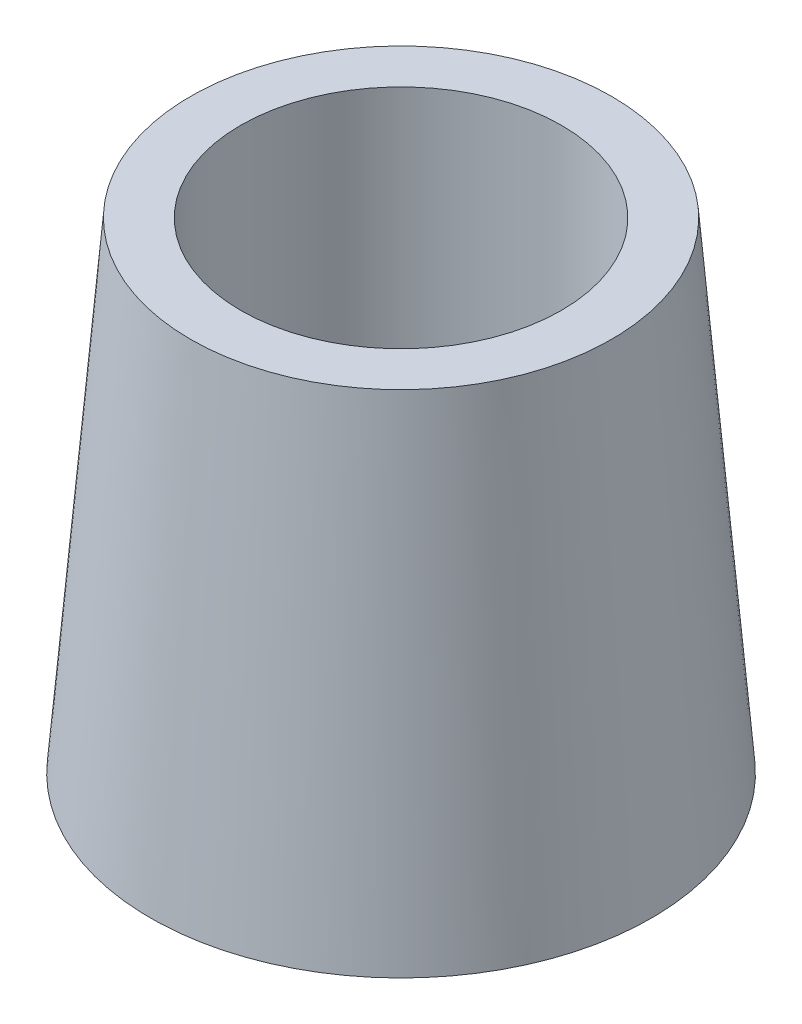
ISO-10303-21;
HEADER;
FILE_DESCRIPTION(('STEP AP214'),'2;1');
FILE_NAME('part.step','',(''),(''),'','','');
FILE_SCHEMA(('AUTOMOTIVE_DESIGN { 1 0 10303 214 1 1 1 1 }'));
ENDSEC;
DATA;
#1=APPLICATION_CONTEXT('core data for automotive mechanical design processes');
#2=APPLICATION_PROTOCOL_DEFINITION('international standard','automotive_design',2000,#1);
#3=PRODUCT_CONTEXT('',#1,'mechanical');
#4=PRODUCT('Part','Part','',(#3));
#5=PRODUCT_RELATED_PRODUCT_CATEGORY('part','',(#4));
#6=PRODUCT_DEFINITION_FORMATION('','',#4);
#7=PRODUCT_DEFINITION_CONTEXT('part definition',#1,'design');
#8=PRODUCT_DEFINITION('design','',#6,#7);
#9=PRODUCT_DEFINITION_SHAPE('','',#8);
#10=(LENGTH_UNIT() NAMED_UNIT(*) SI_UNIT(.MILLI.,.METRE.));
#11=(NAMED_UNIT(*) PLANE_ANGLE_UNIT() SI_UNIT($,.RADIAN.));
#12=(NAMED_UNIT(*) SI_UNIT($,.STERADIAN.) SOLID_ANGLE_UNIT());
#13=UNCERTAINTY_MEASURE_WITH_UNIT(LENGTH_MEASURE(1.E-05),#10,'distance_accuracy_value','');
#14=(GEOMETRIC_REPRESENTATION_CONTEXT(3) GLOBAL_UNCERTAINTY_ASSIGNED_CONTEXT((#13)) GLOBAL_UNIT_ASSIGNED_CONTEXT((#10,
#11,#12)) REPRESENTATION_CONTEXT('',''));
#15=CARTESIAN_POINT('',(0.,0.,0.));
#16=DIRECTION('',(0.,0.,1.));
#17=DIRECTION('',(1.,0.,0.));
#18=AXIS2_PLACEMENT_3D('',#15,#16,#17);
#19=CARTESIAN_POINT('',(0.,0.,0.));
#20=DIRECTION('',(0.,-1.,0.));
#21=DIRECTION('',(0.,0.,-1.));
#22=AXIS2_PLACEMENT_3D('',#19,#20,#21);
#23=CONICAL_SURFACE('',#22,12.5,0.0831412318884412);
#24=CARTESIAN_POINT('',(0.,24.,0.));
#25=DIRECTION('',(0.,-1.,0.));
#26=DIRECTION('',(0.,0.,-1.));
#27=AXIS2_PLACEMENT_3D('',#24,#25,#26);
#28=CIRCLE('',#27,10.5);
#29=CARTESIAN_POINT('',(0.,24.,-10.5));
#30=VERTEX_POINT('',#29);
#31=EDGE_CURVE('E10',#30,#30,#28,.T.);
#32=ORIENTED_EDGE('',*,*,#31,.T.);
#33=EDGE_LOOP('',(#32));
#34=FACE_BOUND('',#33,.T.);
#35=CARTESIAN_POINT('',(0.,0.,0.));
#36=DIRECTION('',(0.,-1.,0.));
#37=DIRECTION('',(0.,0.,-1.));
#38=AXIS2_PLACEMENT_3D('',#35,#36,#37);
#39=CIRCLE('',#38,12.5);
#40=CARTESIAN_POINT('',(0.,0.,-12.5));
#41=VERTEX_POINT('',#40);
#42=EDGE_CURVE('E49',#41,#41,#39,.T.);
#43=ORIENTED_EDGE('',*,*,#42,.F.);
#44=EDGE_LOOP('',(#43));
#45=FACE_BOUND('',#44,.T.);
#46=ADVANCED_FACE('F35',(#34,#45),#23,.T.);
#47=CARTESIAN_POINT('',(10.5,24.,0.));
#48=DIRECTION('',(0.,1.,0.));
#49=DIRECTION('',(0.,0.,1.));
#50=AXIS2_PLACEMENT_3D('',#47,#48,#49);
#51=PLANE('',#50);
#52=CARTESIAN_POINT('',(0.,24.,0.));
#53=DIRECTION('',(0.,-1.,0.));
#54=DIRECTION('',(0.,0.,-1.));
#55=AXIS2_PLACEMENT_3D('',#52,#53,#54);
#56=CIRCLE('',#55,8.);
#57=CARTESIAN_POINT('',(0.,24.,-8.));
#58=VERTEX_POINT('',#57);
#59=EDGE_CURVE('E41',#58,#58,#56,.T.);
#60=ORIENTED_EDGE('',*,*,#59,.T.);
#61=EDGE_LOOP('',(#60));
#62=FACE_BOUND('',#61,.T.);
#63=ORIENTED_EDGE('',*,*,#31,.F.);
#64=EDGE_LOOP('',(#63));
#65=FACE_BOUND('',#64,.T.);
#66=ADVANCED_FACE('F59',(#62,#65),#51,.T.);
#67=CARTESIAN_POINT('',(0.,0.,0.));
#68=DIRECTION('',(0.,-1.,0.));
#69=DIRECTION('',(0.,0.,-1.));
#70=AXIS2_PLACEMENT_3D('',#67,#68,#69);
#71=CYLINDRICAL_SURFACE('',#70,8.);
#72=CARTESIAN_POINT('',(0.,0.,0.));
#73=DIRECTION('',(0.,-1.,0.));
#74=DIRECTION('',(0.,0.,-1.));
#75=AXIS2_PLACEMENT_3D('',#72,#73,#74);
#76=CIRCLE('',#75,8.);
#77=CARTESIAN_POINT('',(0.,0.,-8.));
#78=VERTEX_POINT('',#77);
#79=EDGE_CURVE('E45',#78,#78,#76,.T.);
#80=ORIENTED_EDGE('',*,*,#79,.T.);
#81=EDGE_LOOP('',(#80));
#82=FACE_BOUND('',#81,.T.);
#83=ORIENTED_EDGE('',*,*,#59,.F.);
#84=EDGE_LOOP('',(#83));
#85=FACE_BOUND('',#84,.T.);
#86=ADVANCED_FACE('F63',(#82,#85),#71,.F.);
#87=CARTESIAN_POINT('',(8.,0.,0.));
#88=DIRECTION('',(0.,-1.,0.));
#89=DIRECTION('',(0.,0.,-1.));
#90=AXIS2_PLACEMENT_3D('',#87,#88,#89);
#91=PLANE('',#90);
#92=ORIENTED_EDGE('',*,*,#42,.T.);
#93=EDGE_LOOP('',(#92));
#94=FACE_BOUND('',#93,.T.);
#95=ORIENTED_EDGE('',*,*,#79,.F.);
#96=EDGE_LOOP('',(#95));
#97=FACE_BOUND('',#96,.T.);
#98=ADVANCED_FACE('F55',(#94,#97),#91,.T.);
#99=CLOSED_SHELL('',(#46,#66,#86,#98));
#100=MANIFOLD_SOLID_BREP('B2',#99);
#101=ADVANCED_BREP_SHAPE_REPRESENTATION('',(#18,#100),#14);
#102=SHAPE_DEFINITION_REPRESENTATION(#9,#101);
ENDSEC;
END-ISO-10303-21;
